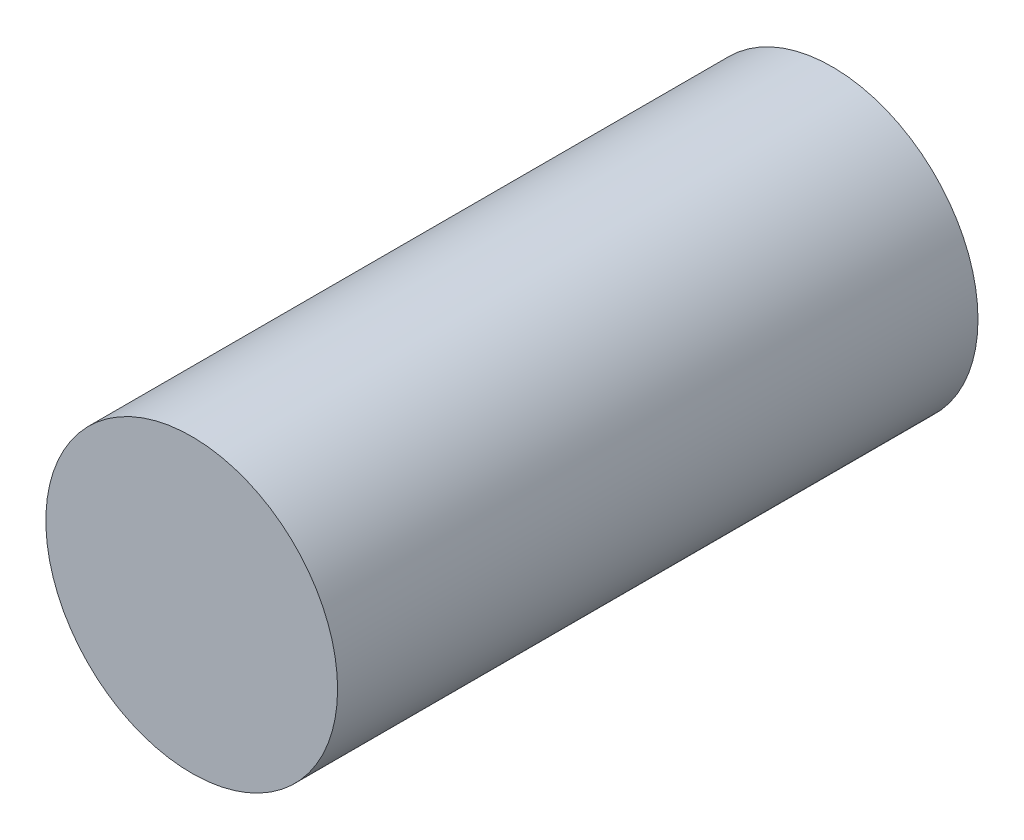
ISO-10303-21;
HEADER;
FILE_DESCRIPTION(('STEP AP214'),'2;1');
FILE_NAME('part.step','',(''),(''),'','','');
FILE_SCHEMA(('AUTOMOTIVE_DESIGN { 1 0 10303 214 1 1 1 1 }'));
ENDSEC;
DATA;
#1=APPLICATION_CONTEXT('core data for automotive mechanical design processes');
#2=APPLICATION_PROTOCOL_DEFINITION('international standard','automotive_design',2000,#1);
#3=PRODUCT_CONTEXT('',#1,'mechanical');
#4=PRODUCT('Part','Part','',(#3));
#5=PRODUCT_RELATED_PRODUCT_CATEGORY('part','',(#4));
#6=PRODUCT_DEFINITION_FORMATION('','',#4);
#7=PRODUCT_DEFINITION_CONTEXT('part definition',#1,'design');
#8=PRODUCT_DEFINITION('design','',#6,#7);
#9=PRODUCT_DEFINITION_SHAPE('','',#8);
#10=(LENGTH_UNIT() NAMED_UNIT(*) SI_UNIT(.MILLI.,.METRE.));
#11=(NAMED_UNIT(*) PLANE_ANGLE_UNIT() SI_UNIT($,.RADIAN.));
#12=(NAMED_UNIT(*) SI_UNIT($,.STERADIAN.) SOLID_ANGLE_UNIT());
#13=UNCERTAINTY_MEASURE_WITH_UNIT(LENGTH_MEASURE(1.E-05),#10,'distance_accuracy_value','');
#14=(GEOMETRIC_REPRESENTATION_CONTEXT(3) GLOBAL_UNCERTAINTY_ASSIGNED_CONTEXT((#13)) GLOBAL_UNIT_ASSIGNED_CONTEXT((#10,
#11,#12)) REPRESENTATION_CONTEXT('',''));
#15=CARTESIAN_POINT('',(0.,0.,0.));
#16=DIRECTION('',(0.,0.,1.));
#17=DIRECTION('',(1.,0.,0.));
#18=AXIS2_PLACEMENT_3D('',#15,#16,#17);
#19=CARTESIAN_POINT('',(10.16,-1.27,0.1));
#20=DIRECTION('',(0.,0.,1.));
#21=DIRECTION('',(1.,0.,0.));
#22=AXIS2_PLACEMENT_3D('',#19,#20,#21);
#23=PLANE('',#22);
#24=CARTESIAN_POINT('',(10.16,-1.27,0.1));
#25=DIRECTION('',(0.,0.,1.));
#26=DIRECTION('',(1.,0.,0.));
#27=AXIS2_PLACEMENT_3D('',#24,#25,#26);
#28=CIRCLE('',#27,0.41);
#29=CARTESIAN_POINT('',(10.57,-1.27,0.1));
#30=VERTEX_POINT('',#29);
#31=EDGE_CURVE('E17',#30,#30,#28,.F.);
#32=ORIENTED_EDGE('',*,*,#31,.F.);
#33=EDGE_LOOP('',(#32));
#34=FACE_BOUND('',#33,.T.);
#35=ADVANCED_FACE('F14',(#34),#23,.T.);
#36=CARTESIAN_POINT('',(10.16,-1.27,-1.7));
#37=DIRECTION('',(0.,0.,1.));
#38=DIRECTION('',(1.,0.,0.));
#39=AXIS2_PLACEMENT_3D('',#36,#37,#38);
#40=PLANE('',#39);
#41=CARTESIAN_POINT('',(10.16,-1.27,-1.7));
#42=DIRECTION('',(0.,0.,1.));
#43=DIRECTION('',(1.,0.,0.));
#44=AXIS2_PLACEMENT_3D('',#41,#42,#43);
#45=CIRCLE('',#44,0.41);
#46=CARTESIAN_POINT('',(10.57,-1.27,-1.7));
#47=VERTEX_POINT('',#46);
#48=EDGE_CURVE('E10',#47,#47,#45,.T.);
#49=ORIENTED_EDGE('',*,*,#48,.F.);
#50=EDGE_LOOP('',(#49));
#51=FACE_BOUND('',#50,.T.);
#52=ADVANCED_FACE('F29',(#51),#40,.F.);
#53=CARTESIAN_POINT('',(10.16,-1.27,-1.7));
#54=DIRECTION('',(0.,0.,1.));
#55=DIRECTION('',(1.,0.,0.));
#56=AXIS2_PLACEMENT_3D('',#53,#54,#55);
#57=CYLINDRICAL_SURFACE('',#56,0.41);
#58=ORIENTED_EDGE('',*,*,#48,.T.);
#59=EDGE_LOOP('',(#58));
#60=FACE_BOUND('',#59,.T.);
#61=ORIENTED_EDGE('',*,*,#31,.T.);
#62=EDGE_LOOP('',(#61));
#63=FACE_BOUND('',#62,.T.);
#64=ADVANCED_FACE('F26',(#60,#63),#57,.T.);
#65=CLOSED_SHELL('',(#35,#52,#64));
#66=MANIFOLD_SOLID_BREP('B1',#65);
#67=ADVANCED_BREP_SHAPE_REPRESENTATION('',(#18,#66),#14);
#68=SHAPE_DEFINITION_REPRESENTATION(#9,#67);
ENDSEC;
END-ISO-10303-21;
